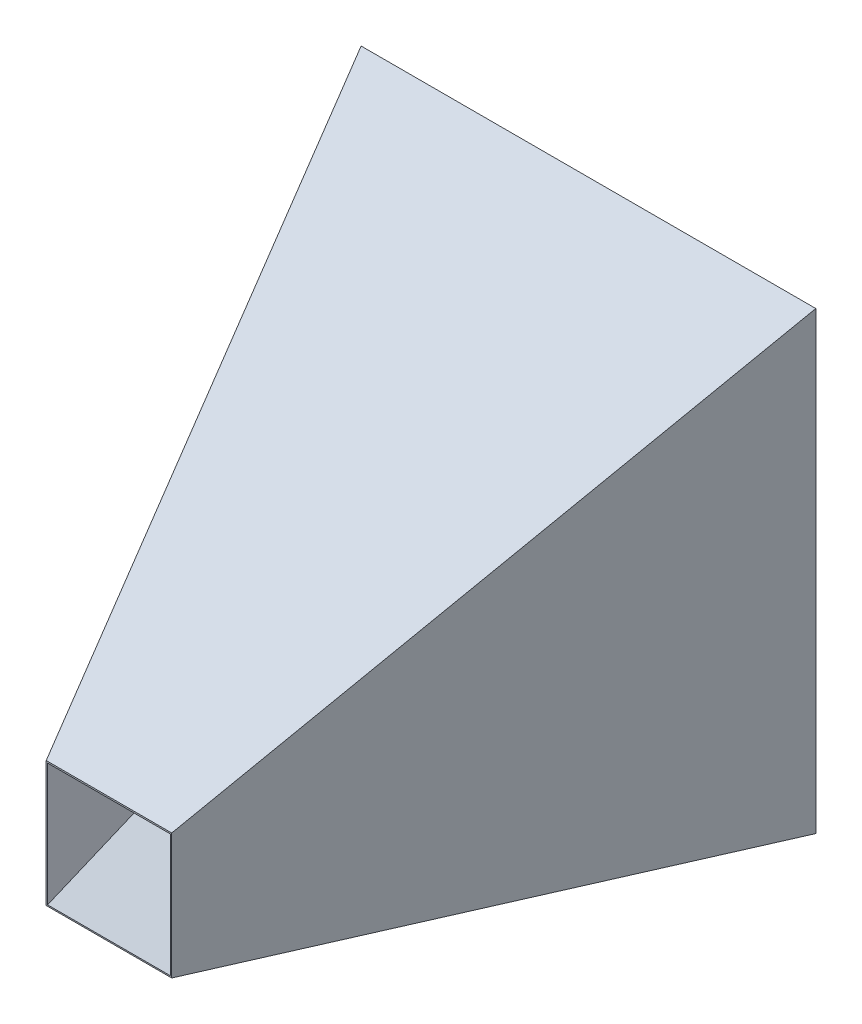
ISO-10303-21;
HEADER;
FILE_DESCRIPTION(('STEP AP214'),'2;1');
FILE_NAME('part.step','',(''),(''),'','','');
FILE_SCHEMA(('AUTOMOTIVE_DESIGN { 1 0 10303 214 1 1 1 1 }'));
ENDSEC;
DATA;
#1=APPLICATION_CONTEXT('core data for automotive mechanical design processes');
#2=APPLICATION_PROTOCOL_DEFINITION('international standard','automotive_design',2000,#1);
#3=PRODUCT_CONTEXT('',#1,'mechanical');
#4=PRODUCT('Part','Part','',(#3));
#5=PRODUCT_RELATED_PRODUCT_CATEGORY('part','',(#4));
#6=PRODUCT_DEFINITION_FORMATION('','',#4);
#7=PRODUCT_DEFINITION_CONTEXT('part definition',#1,'design');
#8=PRODUCT_DEFINITION('design','',#6,#7);
#9=PRODUCT_DEFINITION_SHAPE('','',#8);
#10=(LENGTH_UNIT() NAMED_UNIT(*) SI_UNIT(.MILLI.,.METRE.));
#11=(NAMED_UNIT(*) PLANE_ANGLE_UNIT() SI_UNIT($,.RADIAN.));
#12=(NAMED_UNIT(*) SI_UNIT($,.STERADIAN.) SOLID_ANGLE_UNIT());
#13=UNCERTAINTY_MEASURE_WITH_UNIT(LENGTH_MEASURE(1.E-05),#10,'distance_accuracy_value','');
#14=(GEOMETRIC_REPRESENTATION_CONTEXT(3) GLOBAL_UNCERTAINTY_ASSIGNED_CONTEXT((#13)) GLOBAL_UNIT_ASSIGNED_CONTEXT((#10,
#11,#12)) REPRESENTATION_CONTEXT('',''));
#15=CARTESIAN_POINT('',(0.,0.,0.));
#16=DIRECTION('',(0.,0.,1.));
#17=DIRECTION('',(1.,0.,0.));
#18=AXIS2_PLACEMENT_3D('',#15,#16,#17);
#19=CARTESIAN_POINT('',(0.,0.,740.));
#20=DIRECTION('',(0.,0.,-1.));
#21=DIRECTION('',(-1.,0.,0.));
#22=AXIS2_PLACEMENT_3D('',#19,#20,#21);
#23=PLANE('',#22);
#24=DIRECTION('',(-1.,0.,0.));
#25=VECTOR('',#24,1.);
#26=CARTESIAN_POINT('',(0.,242.352071961651,740.));
#27=LINE('',#26,#25);
#28=CARTESIAN_POINT('',(446.114536283947,242.352071961651,740.));
#29=VERTEX_POINT('',#28);
#30=CARTESIAN_POINT('',(251.885463716053,242.352071961651,740.));
#31=VERTEX_POINT('',#30);
#32=EDGE_CURVE('E232',#29,#31,#27,.T.);
#33=ORIENTED_EDGE('',*,*,#32,.T.);
#34=DIRECTION('',(0.,-1.,0.));
#35=VECTOR('',#34,1.);
#36=CARTESIAN_POINT('',(251.885463716053,0.,740.));
#37=LINE('',#36,#35);
#38=CARTESIAN_POINT('',(251.885463716053,47.9954398226174,740.));
#39=VERTEX_POINT('',#38);
#40=EDGE_CURVE('E12',#31,#39,#37,.T.);
#41=ORIENTED_EDGE('',*,*,#40,.T.);
#42=DIRECTION('',(1.,0.,0.));
#43=VECTOR('',#42,1.);
#44=CARTESIAN_POINT('',(0.,47.9954398226174,740.));
#45=LINE('',#44,#43);
#46=CARTESIAN_POINT('',(446.114536283947,47.9954398226174,740.));
#47=VERTEX_POINT('',#46);
#48=EDGE_CURVE('E54',#39,#47,#45,.T.);
#49=ORIENTED_EDGE('',*,*,#48,.T.);
#50=DIRECTION('',(0.,1.,0.));
#51=VECTOR('',#50,1.);
#52=CARTESIAN_POINT('',(446.114536283947,0.,740.));
#53=LINE('',#52,#51);
#54=EDGE_CURVE('E70',#47,#29,#53,.T.);
#55=ORIENTED_EDGE('',*,*,#54,.T.);
#56=EDGE_LOOP('',(#33,#41,#49,#55));
#57=FACE_BOUND('',#56,.T.);
#58=DIRECTION('',(-1.,0.,0.));
#59=VECTOR('',#58,1.);
#60=CARTESIAN_POINT('',(254.,240.,740.));
#61=LINE('',#60,#59);
#62=CARTESIAN_POINT('',(444.,240.,740.));
#63=VERTEX_POINT('',#62);
#64=CARTESIAN_POINT('',(254.,240.,740.));
#65=VERTEX_POINT('',#64);
#66=EDGE_CURVE('E124',#63,#65,#61,.T.);
#67=ORIENTED_EDGE('',*,*,#66,.F.);
#68=DIRECTION('',(0.,1.,0.));
#69=VECTOR('',#68,1.);
#70=CARTESIAN_POINT('',(444.,240.,740.));
#71=LINE('',#70,#69);
#72=CARTESIAN_POINT('',(444.,50.,740.));
#73=VERTEX_POINT('',#72);
#74=EDGE_CURVE('E135',#73,#63,#71,.T.);
#75=ORIENTED_EDGE('',*,*,#74,.F.);
#76=DIRECTION('',(1.,0.,0.));
#77=VECTOR('',#76,1.);
#78=CARTESIAN_POINT('',(254.,50.,740.));
#79=LINE('',#78,#77);
#80=CARTESIAN_POINT('',(254.,50.,740.));
#81=VERTEX_POINT('',#80);
#82=EDGE_CURVE('E140',#81,#73,#79,.T.);
#83=ORIENTED_EDGE('',*,*,#82,.F.);
#84=DIRECTION('',(0.,-1.,0.));
#85=VECTOR('',#84,1.);
#86=CARTESIAN_POINT('',(254.,240.,740.));
#87=LINE('',#86,#85);
#88=EDGE_CURVE('E117',#65,#81,#87,.T.);
#89=ORIENTED_EDGE('',*,*,#88,.F.);
#90=EDGE_LOOP('',(#67,#75,#83,#89));
#91=FACE_BOUND('',#90,.T.);
#92=ADVANCED_FACE('F45',(#57,#91),#23,.F.);
#93=CARTESIAN_POINT('',(0.,0.,-2.));
#94=DIRECTION('',(0.,0.,-1.));
#95=DIRECTION('',(-1.,0.,0.));
#96=AXIS2_PLACEMENT_3D('',#93,#94,#95);
#97=PLANE('',#96);
#98=DIRECTION('',(0.,-1.,0.));
#99=VECTOR('',#98,1.);
#100=CARTESIAN_POINT('',(-2.80102277043353,0.,-2.));
#101=LINE('',#100,#99);
#102=CARTESIAN_POINT('',(-2.80102277043353,701.589909799488,-2.));
#103=VERTEX_POINT('',#102);
#104=CARTESIAN_POINT('',(-2.80102277043353,-2.13969531251769,-2.));
#105=VERTEX_POINT('',#104);
#106=EDGE_CURVE('E141',#103,#105,#101,.T.);
#107=ORIENTED_EDGE('',*,*,#106,.F.);
#108=DIRECTION('',(-1.,0.,0.));
#109=VECTOR('',#108,1.);
#110=CARTESIAN_POINT('',(0.,701.589909799488,-2.));
#111=LINE('',#110,#109);
#112=CARTESIAN_POINT('',(700.801022770433,701.589909799488,-2.));
#113=VERTEX_POINT('',#112);
#114=EDGE_CURVE('E143',#113,#103,#111,.T.);
#115=ORIENTED_EDGE('',*,*,#114,.F.);
#116=DIRECTION('',(0.,1.,0.));
#117=VECTOR('',#116,1.);
#118=CARTESIAN_POINT('',(700.801022770433,0.,-2.));
#119=LINE('',#118,#117);
#120=CARTESIAN_POINT('',(700.801022770433,-2.13969531251769,-2.));
#121=VERTEX_POINT('',#120);
#122=EDGE_CURVE('E219',#121,#113,#119,.T.);
#123=ORIENTED_EDGE('',*,*,#122,.F.);
#124=DIRECTION('',(1.,0.,0.));
#125=VECTOR('',#124,1.);
#126=CARTESIAN_POINT('',(0.,-2.13969531251769,-2.));
#127=LINE('',#126,#125);
#128=EDGE_CURVE('E221',#105,#121,#127,.T.);
#129=ORIENTED_EDGE('',*,*,#128,.F.);
#130=EDGE_LOOP('',(#107,#115,#123,#129));
#131=FACE_BOUND('',#130,.T.);
#132=ADVANCED_FACE('F300',(#131),#97,.T.);
#133=CARTESIAN_POINT('',(0.,506.378431779435,313.407191560785));
#134=DIRECTION('',(0.,0.850314119894718,0.526275495826731));
#135=DIRECTION('',(0.,-0.526275495826731,0.850314119894718));
#136=AXIS2_PLACEMENT_3D('',#133,#134,#135);
#137=PLANE('',#136);
#138=DIRECTION('',(0.28017508379268,0.50519759203562,-0.816258118136154));
#139=VECTOR('',#138,1.);
#140=CARTESIAN_POINT('',(546.026413129304,422.508133359972,448.918154072582));
#141=LINE('',#140,#139);
#142=EDGE_CURVE('E225',#29,#113,#141,.T.);
#143=ORIENTED_EDGE('',*,*,#142,.T.);
#144=ORIENTED_EDGE('',*,*,#114,.T.);
#145=DIRECTION('',(-0.28017508379268,0.50519759203562,-0.816258118136154));
#146=VECTOR('',#145,1.);
#147=CARTESIAN_POINT('',(97.1819287210876,521.305690180919,289.288913794195));
#148=LINE('',#147,#146);
#149=EDGE_CURVE('E228',#31,#103,#148,.T.);
#150=ORIENTED_EDGE('',*,*,#149,.F.);
#151=ORIENTED_EDGE('',*,*,#32,.F.);
#152=EDGE_LOOP('',(#143,#144,#150,#151));
#153=FACE_BOUND('',#152,.T.);
#154=ADVANCED_FACE('F304',(#153),#137,.T.);
#155=CARTESIAN_POINT('',(-1.89166770528691,0.,0.649302158301181));
#156=DIRECTION('',(-0.945833852643453,0.,0.324651079150591));
#157=DIRECTION('',(0.324651079150591,0.,0.945833852643453));
#158=AXIS2_PLACEMENT_3D('',#155,#156,#157);
#159=PLANE('',#158);
#160=ORIENTED_EDGE('',*,*,#149,.T.);
#161=ORIENTED_EDGE('',*,*,#106,.T.);
#162=DIRECTION('',(-0.323990134169533,-0.0637775854664435,-0.943908264903364));
#163=VECTOR('',#162,1.);
#164=CARTESIAN_POINT('',(-1.8511533958545,-1.95271315216749,0.767335973182996));
#165=LINE('',#164,#163);
#166=EDGE_CURVE('E224',#39,#105,#165,.T.);
#167=ORIENTED_EDGE('',*,*,#166,.F.);
#168=ORIENTED_EDGE('',*,*,#40,.F.);
#169=EDGE_LOOP('',(#160,#161,#167,#168));
#170=FACE_BOUND('',#169,.T.);
#171=ADVANCED_FACE('F317',(#170),#159,.T.);
#172=CARTESIAN_POINT('',(626.323638116124,0.,214.981356866886));
#173=DIRECTION('',(0.945833852643453,0.,0.32465107915059));
#174=DIRECTION('',(0.32465107915059,0.,-0.945833852643453));
#175=AXIS2_PLACEMENT_3D('',#172,#173,#174);
#176=PLANE('',#175);
#177=DIRECTION('',(0.323990134169533,-0.0637775854664435,-0.943908264903364));
#178=VECTOR('',#177,1.);
#179=CARTESIAN_POINT('',(626.582367682498,12.4702761614853,214.227577815244));
#180=LINE('',#179,#178);
#181=EDGE_CURVE('E229',#47,#121,#180,.T.);
#182=ORIENTED_EDGE('',*,*,#181,.T.);
#183=ORIENTED_EDGE('',*,*,#122,.T.);
#184=ORIENTED_EDGE('',*,*,#142,.F.);
#185=ORIENTED_EDGE('',*,*,#54,.F.);
#186=EDGE_LOOP('',(#182,#183,#184,#185));
#187=FACE_BOUND('',#186,.T.);
#188=ADVANCED_FACE('F312',(#187),#176,.T.);
#189=CARTESIAN_POINT('',(0.,-1.99545019657278,0.134827715984648));
#190=DIRECTION('',(0.,-0.997725098286392,0.0674138579923238));
#191=DIRECTION('',(0.,-0.0674138579923238,-0.997725098286392));
#192=AXIS2_PLACEMENT_3D('',#189,#190,#191);
#193=PLANE('',#192);
#194=ORIENTED_EDGE('',*,*,#166,.T.);
#195=ORIENTED_EDGE('',*,*,#128,.T.);
#196=ORIENTED_EDGE('',*,*,#181,.F.);
#197=ORIENTED_EDGE('',*,*,#48,.F.);
#198=EDGE_LOOP('',(#194,#195,#196,#197));
#199=FACE_BOUND('',#198,.T.);
#200=ADVANCED_FACE('F47',(#199),#193,.T.);
#201=CARTESIAN_POINT('',(0.,0.,0.));
#202=DIRECTION('',(0.,0.,-1.));
#203=DIRECTION('',(-1.,0.,0.));
#204=AXIS2_PLACEMENT_3D('',#201,#202,#203);
#205=PLANE('',#204);
#206=DIRECTION('',(0.,-1.,0.));
#207=VECTOR('',#206,1.);
#208=CARTESIAN_POINT('',(0.,0.,0.));
#209=LINE('',#208,#207);
#210=CARTESIAN_POINT('',(0.,698.,1.11022302462516E-13));
#211=VERTEX_POINT('',#210);
#212=CARTESIAN_POINT('',(0.,0.,0.));
#213=VERTEX_POINT('',#212);
#214=EDGE_CURVE('E120',#211,#213,#209,.T.);
#215=ORIENTED_EDGE('',*,*,#214,.T.);
#216=DIRECTION('',(1.,0.,0.));
#217=VECTOR('',#216,1.);
#218=CARTESIAN_POINT('',(0.,0.,0.));
#219=LINE('',#218,#217);
#220=CARTESIAN_POINT('',(698.,0.,0.));
#221=VERTEX_POINT('',#220);
#222=EDGE_CURVE('E161',#213,#221,#219,.T.);
#223=ORIENTED_EDGE('',*,*,#222,.T.);
#224=DIRECTION('',(0.,1.,0.));
#225=VECTOR('',#224,1.);
#226=CARTESIAN_POINT('',(698.,0.,0.));
#227=LINE('',#226,#225);
#228=CARTESIAN_POINT('',(698.,698.,0.));
#229=VERTEX_POINT('',#228);
#230=EDGE_CURVE('E166',#221,#229,#227,.T.);
#231=ORIENTED_EDGE('',*,*,#230,.T.);
#232=DIRECTION('',(-1.,0.,0.));
#233=VECTOR('',#232,1.);
#234=CARTESIAN_POINT('',(0.,698.,0.));
#235=LINE('',#234,#233);
#236=EDGE_CURVE('E202',#229,#211,#235,.T.);
#237=ORIENTED_EDGE('',*,*,#236,.T.);
#238=EDGE_LOOP('',(#215,#223,#231,#237));
#239=FACE_BOUND('',#238,.T.);
#240=ADVANCED_FACE('F176',(#239),#205,.F.);
#241=CARTESIAN_POINT('',(0.,504.677803539645,312.354640569132));
#242=DIRECTION('',(0.,0.850314119894718,0.526275495826731));
#243=DIRECTION('',(0.,-0.526275495826731,0.850314119894718));
#244=AXIS2_PLACEMENT_3D('',#241,#242,#243);
#245=PLANE('',#244);
#246=DIRECTION('',(0.28017508379268,0.50519759203562,-0.816258118136154));
#247=VECTOR('',#246,1.);
#248=CARTESIAN_POINT('',(444.,240.,740.));
#249=LINE('',#248,#247);
#250=EDGE_CURVE('E125',#63,#229,#249,.T.);
#251=ORIENTED_EDGE('',*,*,#250,.F.);
#252=ORIENTED_EDGE('',*,*,#66,.T.);
#253=DIRECTION('',(-0.28017508379268,0.50519759203562,-0.816258118136154));
#254=VECTOR('',#253,1.);
#255=CARTESIAN_POINT('',(254.,240.,740.));
#256=LINE('',#255,#254);
#257=EDGE_CURVE('E112',#65,#211,#256,.T.);
#258=ORIENTED_EDGE('',*,*,#257,.T.);
#259=ORIENTED_EDGE('',*,*,#236,.F.);
#260=EDGE_LOOP('',(#251,#252,#258,#259));
#261=FACE_BOUND('',#260,.T.);
#262=ADVANCED_FACE('F130',(#261),#245,.F.);
#263=CARTESIAN_POINT('',(0.,0.,0.));
#264=DIRECTION('',(-0.945833852643453,0.,0.324651079150591));
#265=DIRECTION('',(0.324651079150591,0.,0.945833852643453));
#266=AXIS2_PLACEMENT_3D('',#263,#264,#265);
#267=PLANE('',#266);
#268=ORIENTED_EDGE('',*,*,#257,.F.);
#269=ORIENTED_EDGE('',*,*,#88,.T.);
#270=DIRECTION('',(-0.323990134169533,-0.0637775854664435,-0.943908264903364));
#271=VECTOR('',#270,1.);
#272=CARTESIAN_POINT('',(254.,50.,740.));
#273=LINE('',#272,#271);
#274=EDGE_CURVE('E165',#81,#213,#273,.T.);
#275=ORIENTED_EDGE('',*,*,#274,.T.);
#276=ORIENTED_EDGE('',*,*,#214,.F.);
#277=EDGE_LOOP('',(#268,#269,#275,#276));
#278=FACE_BOUND('',#277,.T.);
#279=ADVANCED_FACE('F114',(#278),#267,.F.);
#280=CARTESIAN_POINT('',(624.431970410837,0.,214.332054708584));
#281=DIRECTION('',(0.945833852643453,0.,0.32465107915059));
#282=DIRECTION('',(0.32465107915059,0.,-0.945833852643453));
#283=AXIS2_PLACEMENT_3D('',#280,#281,#282);
#284=PLANE('',#283);
#285=DIRECTION('',(0.323990134169533,-0.0637775854664435,-0.943908264903364));
#286=VECTOR('',#285,1.);
#287=CARTESIAN_POINT('',(444.,50.,740.));
#288=LINE('',#287,#286);
#289=EDGE_CURVE('E62',#73,#221,#288,.T.);
#290=ORIENTED_EDGE('',*,*,#289,.F.);
#291=ORIENTED_EDGE('',*,*,#74,.T.);
#292=ORIENTED_EDGE('',*,*,#250,.T.);
#293=ORIENTED_EDGE('',*,*,#230,.F.);
#294=EDGE_LOOP('',(#290,#291,#292,#293));
#295=FACE_BOUND('',#294,.T.);
#296=ADVANCED_FACE('F249',(#295),#284,.F.);
#297=CARTESIAN_POINT('',(0.,0.,0.));
#298=DIRECTION('',(0.,-0.997725098286392,0.0674138579923238));
#299=DIRECTION('',(0.,-0.0674138579923238,-0.997725098286392));
#300=AXIS2_PLACEMENT_3D('',#297,#298,#299);
#301=PLANE('',#300);
#302=ORIENTED_EDGE('',*,*,#274,.F.);
#303=ORIENTED_EDGE('',*,*,#82,.T.);
#304=ORIENTED_EDGE('',*,*,#289,.T.);
#305=ORIENTED_EDGE('',*,*,#222,.F.);
#306=EDGE_LOOP('',(#302,#303,#304,#305));
#307=FACE_BOUND('',#306,.T.);
#308=ADVANCED_FACE('F186',(#307),#301,.F.);
#309=CLOSED_SHELL('',(#92,#132,#154,#171,#188,#200,#240,#262,#279,#296,#308));
#310=MANIFOLD_SOLID_BREP('B2',#309);
#311=ADVANCED_BREP_SHAPE_REPRESENTATION('',(#18,#310),#14);
#312=SHAPE_DEFINITION_REPRESENTATION(#9,#311);
ENDSEC;
END-ISO-10303-21;
